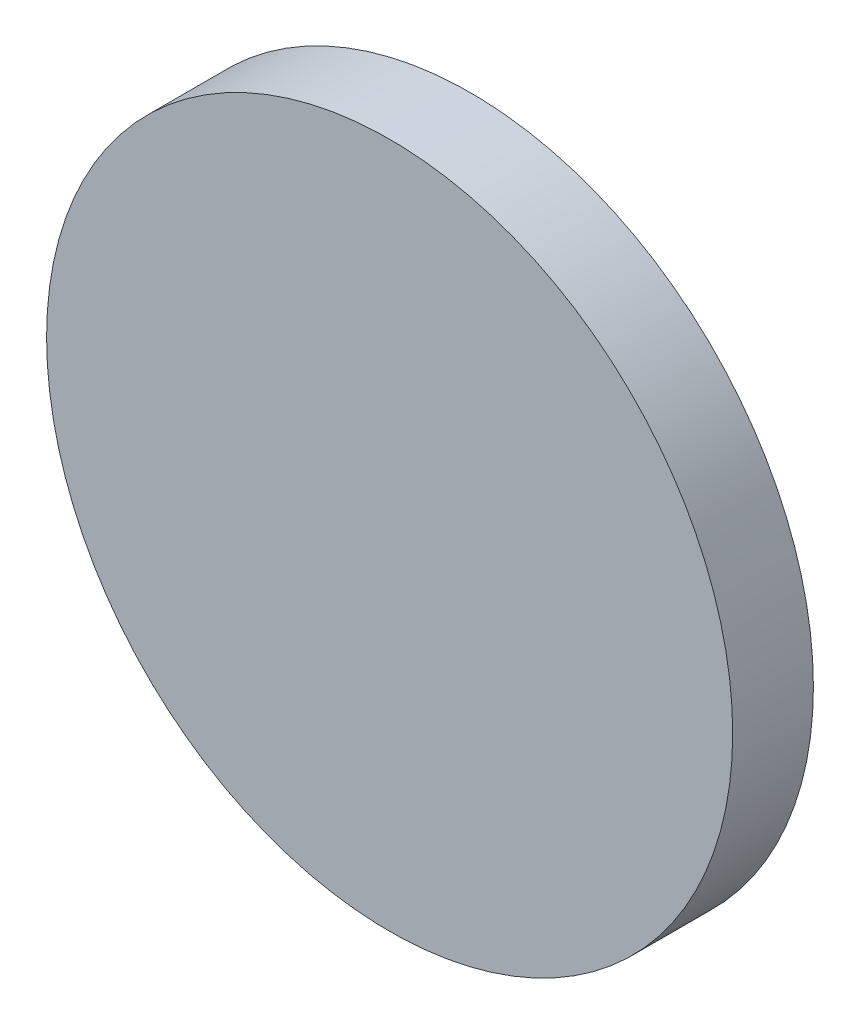
ISO-10303-21;
HEADER;
FILE_DESCRIPTION(('STEP AP214'),'2;1');
FILE_NAME('part.step','',(''),(''),'','','');
FILE_SCHEMA(('AUTOMOTIVE_DESIGN { 1 0 10303 214 1 1 1 1 }'));
ENDSEC;
DATA;
#1=APPLICATION_CONTEXT('core data for automotive mechanical design processes');
#2=APPLICATION_PROTOCOL_DEFINITION('international standard','automotive_design',2000,#1);
#3=PRODUCT_CONTEXT('',#1,'mechanical');
#4=PRODUCT('Part','Part','',(#3));
#5=PRODUCT_RELATED_PRODUCT_CATEGORY('part','',(#4));
#6=PRODUCT_DEFINITION_FORMATION('','',#4);
#7=PRODUCT_DEFINITION_CONTEXT('part definition',#1,'design');
#8=PRODUCT_DEFINITION('design','',#6,#7);
#9=PRODUCT_DEFINITION_SHAPE('','',#8);
#10=(LENGTH_UNIT() NAMED_UNIT(*) SI_UNIT(.MILLI.,.METRE.));
#11=(NAMED_UNIT(*) PLANE_ANGLE_UNIT() SI_UNIT($,.RADIAN.));
#12=(NAMED_UNIT(*) SI_UNIT($,.STERADIAN.) SOLID_ANGLE_UNIT());
#13=UNCERTAINTY_MEASURE_WITH_UNIT(LENGTH_MEASURE(1.E-05),#10,'distance_accuracy_value','');
#14=(GEOMETRIC_REPRESENTATION_CONTEXT(3) GLOBAL_UNCERTAINTY_ASSIGNED_CONTEXT((#13)) GLOBAL_UNIT_ASSIGNED_CONTEXT((#10,
#11,#12)) REPRESENTATION_CONTEXT('',''));
#15=CARTESIAN_POINT('',(0.,0.,0.));
#16=DIRECTION('',(0.,0.,1.));
#17=DIRECTION('',(1.,0.,0.));
#18=AXIS2_PLACEMENT_3D('',#15,#16,#17);
#19=CARTESIAN_POINT('',(0.85000084,0.,0.1999996));
#20=DIRECTION('',(0.,0.,-1.));
#21=DIRECTION('',(0.,-1.,0.));
#22=AXIS2_PLACEMENT_3D('',#19,#20,#21);
#23=PLANE('',#22);
#24=CARTESIAN_POINT('',(0.,0.,0.1999996));
#25=DIRECTION('',(0.,0.,1.));
#26=DIRECTION('',(1.,0.,0.));
#27=AXIS2_PLACEMENT_3D('',#24,#25,#26);
#28=CIRCLE('',#27,0.85000084);
#29=CARTESIAN_POINT('',(-0.85000084,0.,0.1999996));
#30=VERTEX_POINT('',#29);
#31=EDGE_CURVE('E11',#30,#30,#28,.T.);
#32=ORIENTED_EDGE('',*,*,#31,.T.);
#33=EDGE_LOOP('',(#32));
#34=FACE_BOUND('',#33,.T.);
#35=ADVANCED_FACE('F17',(#34),#23,.F.);
#36=CARTESIAN_POINT('',(0.85000084,0.,0.));
#37=DIRECTION('',(0.,0.,-1.));
#38=DIRECTION('',(0.,-1.,0.));
#39=AXIS2_PLACEMENT_3D('',#36,#37,#38);
#40=PLANE('',#39);
#41=CARTESIAN_POINT('',(0.,0.,0.));
#42=DIRECTION('',(0.,0.,1.));
#43=DIRECTION('',(1.,0.,0.));
#44=AXIS2_PLACEMENT_3D('',#41,#42,#43);
#45=CIRCLE('',#44,0.85000084);
#46=CARTESIAN_POINT('',(-0.85000084,0.,0.));
#47=VERTEX_POINT('',#46);
#48=EDGE_CURVE('E42',#47,#47,#45,.T.);
#49=ORIENTED_EDGE('',*,*,#48,.F.);
#50=EDGE_LOOP('',(#49));
#51=FACE_BOUND('',#50,.T.);
#52=ADVANCED_FACE('F65',(#51),#40,.T.);
#53=CARTESIAN_POINT('',(0.,0.,0.));
#54=DIRECTION('',(0.,0.,-1.));
#55=DIRECTION('',(1.,0.,0.));
#56=AXIS2_PLACEMENT_3D('',#53,#54,#55);
#57=CYLINDRICAL_SURFACE('',#56,0.85000084);
#58=ORIENTED_EDGE('',*,*,#48,.T.);
#59=DIRECTION('',(0.,0.,1.));
#60=VECTOR('',#59,1.);
#61=CARTESIAN_POINT('',(-0.85000084,0.,0.));
#62=LINE('',#61,#60);
#63=EDGE_CURVE('E27',#47,#30,#62,.T.);
#64=ORIENTED_EDGE('',*,*,#63,.T.);
#65=ORIENTED_EDGE('',*,*,#31,.F.);
#66=ORIENTED_EDGE('',*,*,#63,.F.);
#67=EDGE_LOOP('',(#58,#64,#65,#66));
#68=FACE_BOUND('',#67,.T.);
#69=ADVANCED_FACE('F19',(#68),#57,.T.);
#70=CLOSED_SHELL('',(#35,#52,#69));
#71=MANIFOLD_SOLID_BREP('B1',#70);
#72=ADVANCED_BREP_SHAPE_REPRESENTATION('',(#18,#71),#14);
#73=SHAPE_DEFINITION_REPRESENTATION(#9,#72);
ENDSEC;
END-ISO-10303-21;
